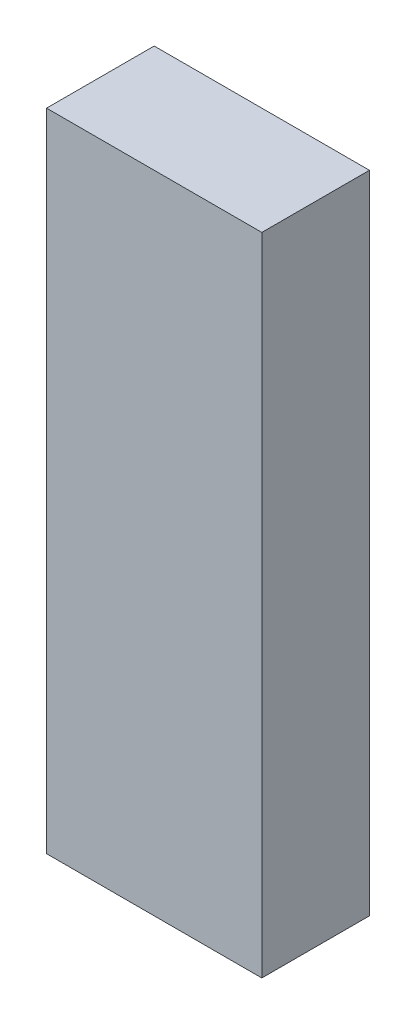
ISO-10303-21;
HEADER;
FILE_DESCRIPTION(('STEP AP214'),'2;1');
FILE_NAME('part.step','',(''),(''),'','','');
FILE_SCHEMA(('AUTOMOTIVE_DESIGN { 1 0 10303 214 1 1 1 1 }'));
ENDSEC;
DATA;
#1=APPLICATION_CONTEXT('core data for automotive mechanical design processes');
#2=APPLICATION_PROTOCOL_DEFINITION('international standard','automotive_design',2000,#1);
#3=PRODUCT_CONTEXT('',#1,'mechanical');
#4=PRODUCT('Part','Part','',(#3));
#5=PRODUCT_RELATED_PRODUCT_CATEGORY('part','',(#4));
#6=PRODUCT_DEFINITION_FORMATION('','',#4);
#7=PRODUCT_DEFINITION_CONTEXT('part definition',#1,'design');
#8=PRODUCT_DEFINITION('design','',#6,#7);
#9=PRODUCT_DEFINITION_SHAPE('','',#8);
#10=(LENGTH_UNIT() NAMED_UNIT(*) SI_UNIT(.MILLI.,.METRE.));
#11=(NAMED_UNIT(*) PLANE_ANGLE_UNIT() SI_UNIT($,.RADIAN.));
#12=(NAMED_UNIT(*) SI_UNIT($,.STERADIAN.) SOLID_ANGLE_UNIT());
#13=UNCERTAINTY_MEASURE_WITH_UNIT(LENGTH_MEASURE(1.E-05),#10,'distance_accuracy_value','');
#14=(GEOMETRIC_REPRESENTATION_CONTEXT(3) GLOBAL_UNCERTAINTY_ASSIGNED_CONTEXT((#13)) GLOBAL_UNIT_ASSIGNED_CONTEXT((#10,
#11,#12)) REPRESENTATION_CONTEXT('',''));
#15=CARTESIAN_POINT('',(0.,0.,0.));
#16=DIRECTION('',(0.,0.,1.));
#17=DIRECTION('',(1.,0.,0.));
#18=AXIS2_PLACEMENT_3D('',#15,#16,#17);
#19=CARTESIAN_POINT('',(0.,0.,5.));
#20=DIRECTION('',(1.,0.,0.));
#21=DIRECTION('',(0.,0.,-1.));
#22=AXIS2_PLACEMENT_3D('',#19,#20,#21);
#23=PLANE('',#22);
#24=DIRECTION('',(0.,-1.,0.));
#25=VECTOR('',#24,1.);
#26=CARTESIAN_POINT('',(0.,0.,0.));
#27=LINE('',#26,#25);
#28=CARTESIAN_POINT('',(0.,30.,0.));
#29=VERTEX_POINT('',#28);
#30=CARTESIAN_POINT('',(0.,0.,0.));
#31=VERTEX_POINT('',#30);
#32=EDGE_CURVE('E98',#29,#31,#27,.T.);
#33=ORIENTED_EDGE('',*,*,#32,.T.);
#34=DIRECTION('',(0.,0.,-1.));
#35=VECTOR('',#34,1.);
#36=CARTESIAN_POINT('',(0.,0.,5.));
#37=LINE('',#36,#35);
#38=CARTESIAN_POINT('',(0.,0.,5.));
#39=VERTEX_POINT('',#38);
#40=EDGE_CURVE('E11',#39,#31,#37,.T.);
#41=ORIENTED_EDGE('',*,*,#40,.F.);
#42=DIRECTION('',(0.,-1.,0.));
#43=VECTOR('',#42,1.);
#44=CARTESIAN_POINT('',(0.,0.,5.));
#45=LINE('',#44,#43);
#46=CARTESIAN_POINT('',(0.,30.,5.));
#47=VERTEX_POINT('',#46);
#48=EDGE_CURVE('E86',#47,#39,#45,.T.);
#49=ORIENTED_EDGE('',*,*,#48,.F.);
#50=DIRECTION('',(0.,0.,-1.));
#51=VECTOR('',#50,1.);
#52=CARTESIAN_POINT('',(0.,30.,5.));
#53=LINE('',#52,#51);
#54=EDGE_CURVE('E94',#47,#29,#53,.T.);
#55=ORIENTED_EDGE('',*,*,#54,.T.);
#56=EDGE_LOOP('',(#33,#41,#49,#55));
#57=FACE_BOUND('',#56,.T.);
#58=ADVANCED_FACE('F35',(#57),#23,.F.);
#59=CARTESIAN_POINT('',(0.,0.,5.));
#60=DIRECTION('',(0.,1.,0.));
#61=DIRECTION('',(0.,0.,1.));
#62=AXIS2_PLACEMENT_3D('',#59,#60,#61);
#63=PLANE('',#62);
#64=DIRECTION('',(1.,0.,0.));
#65=VECTOR('',#64,1.);
#66=CARTESIAN_POINT('',(0.,0.,0.));
#67=LINE('',#66,#65);
#68=CARTESIAN_POINT('',(10.,0.,0.));
#69=VERTEX_POINT('',#68);
#70=EDGE_CURVE('E90',#31,#69,#67,.T.);
#71=ORIENTED_EDGE('',*,*,#70,.T.);
#72=DIRECTION('',(0.,0.,-1.));
#73=VECTOR('',#72,1.);
#74=CARTESIAN_POINT('',(10.,0.,5.));
#75=LINE('',#74,#73);
#76=CARTESIAN_POINT('',(10.,0.,5.));
#77=VERTEX_POINT('',#76);
#78=EDGE_CURVE('E43',#77,#69,#75,.T.);
#79=ORIENTED_EDGE('',*,*,#78,.F.);
#80=DIRECTION('',(1.,0.,0.));
#81=VECTOR('',#80,1.);
#82=CARTESIAN_POINT('',(0.,0.,5.));
#83=LINE('',#82,#81);
#84=EDGE_CURVE('E81',#39,#77,#83,.T.);
#85=ORIENTED_EDGE('',*,*,#84,.F.);
#86=ORIENTED_EDGE('',*,*,#40,.T.);
#87=EDGE_LOOP('',(#71,#79,#85,#86));
#88=FACE_BOUND('',#87,.T.);
#89=ADVANCED_FACE('F89',(#88),#63,.F.);
#90=CARTESIAN_POINT('',(10.,0.,5.));
#91=DIRECTION('',(-1.,0.,0.));
#92=DIRECTION('',(0.,0.,1.));
#93=AXIS2_PLACEMENT_3D('',#90,#91,#92);
#94=PLANE('',#93);
#95=DIRECTION('',(0.,1.,0.));
#96=VECTOR('',#95,1.);
#97=CARTESIAN_POINT('',(10.,0.,0.));
#98=LINE('',#97,#96);
#99=CARTESIAN_POINT('',(10.,30.,0.));
#100=VERTEX_POINT('',#99);
#101=EDGE_CURVE('E68',#69,#100,#98,.T.);
#102=ORIENTED_EDGE('',*,*,#101,.T.);
#103=DIRECTION('',(0.,0.,-1.));
#104=VECTOR('',#103,1.);
#105=CARTESIAN_POINT('',(10.,30.,5.));
#106=LINE('',#105,#104);
#107=CARTESIAN_POINT('',(10.,30.,5.));
#108=VERTEX_POINT('',#107);
#109=EDGE_CURVE('E91',#108,#100,#106,.T.);
#110=ORIENTED_EDGE('',*,*,#109,.F.);
#111=DIRECTION('',(0.,1.,0.));
#112=VECTOR('',#111,1.);
#113=CARTESIAN_POINT('',(10.,0.,5.));
#114=LINE('',#113,#112);
#115=EDGE_CURVE('E84',#77,#108,#114,.T.);
#116=ORIENTED_EDGE('',*,*,#115,.F.);
#117=ORIENTED_EDGE('',*,*,#78,.T.);
#118=EDGE_LOOP('',(#102,#110,#116,#117));
#119=FACE_BOUND('',#118,.T.);
#120=ADVANCED_FACE('F92',(#119),#94,.F.);
#121=CARTESIAN_POINT('',(0.,30.,5.));
#122=DIRECTION('',(0.,-1.,0.));
#123=DIRECTION('',(0.,0.,-1.));
#124=AXIS2_PLACEMENT_3D('',#121,#122,#123);
#125=PLANE('',#124);
#126=DIRECTION('',(-1.,0.,0.));
#127=VECTOR('',#126,1.);
#128=CARTESIAN_POINT('',(0.,30.,0.));
#129=LINE('',#128,#127);
#130=EDGE_CURVE('E74',#100,#29,#129,.T.);
#131=ORIENTED_EDGE('',*,*,#130,.T.);
#132=ORIENTED_EDGE('',*,*,#54,.F.);
#133=DIRECTION('',(-1.,0.,0.));
#134=VECTOR('',#133,1.);
#135=CARTESIAN_POINT('',(0.,30.,5.));
#136=LINE('',#135,#134);
#137=EDGE_CURVE('E51',#108,#47,#136,.T.);
#138=ORIENTED_EDGE('',*,*,#137,.F.);
#139=ORIENTED_EDGE('',*,*,#109,.T.);
#140=EDGE_LOOP('',(#131,#132,#138,#139));
#141=FACE_BOUND('',#140,.T.);
#142=ADVANCED_FACE('F105',(#141),#125,.F.);
#143=CARTESIAN_POINT('',(0.,0.,5.));
#144=DIRECTION('',(0.,0.,-1.));
#145=DIRECTION('',(-1.,0.,0.));
#146=AXIS2_PLACEMENT_3D('',#143,#144,#145);
#147=PLANE('',#146);
#148=ORIENTED_EDGE('',*,*,#48,.T.);
#149=ORIENTED_EDGE('',*,*,#84,.T.);
#150=ORIENTED_EDGE('',*,*,#115,.T.);
#151=ORIENTED_EDGE('',*,*,#137,.T.);
#152=EDGE_LOOP('',(#148,#149,#150,#151));
#153=FACE_BOUND('',#152,.T.);
#154=ADVANCED_FACE('F82',(#153),#147,.F.);
#155=CARTESIAN_POINT('',(0.,0.,0.));
#156=DIRECTION('',(0.,0.,-1.));
#157=DIRECTION('',(-1.,0.,0.));
#158=AXIS2_PLACEMENT_3D('',#155,#156,#157);
#159=PLANE('',#158);
#160=ORIENTED_EDGE('',*,*,#32,.F.);
#161=ORIENTED_EDGE('',*,*,#130,.F.);
#162=ORIENTED_EDGE('',*,*,#101,.F.);
#163=ORIENTED_EDGE('',*,*,#70,.F.);
#164=EDGE_LOOP('',(#160,#161,#162,#163));
#165=FACE_BOUND('',#164,.T.);
#166=ADVANCED_FACE('F108',(#165),#159,.T.);
#167=CLOSED_SHELL('',(#58,#89,#120,#142,#154,#166));
#168=MANIFOLD_SOLID_BREP('B2',#167);
#169=ADVANCED_BREP_SHAPE_REPRESENTATION('',(#18,#168),#14);
#170=SHAPE_DEFINITION_REPRESENTATION(#9,#169);
ENDSEC;
END-ISO-10303-21;
